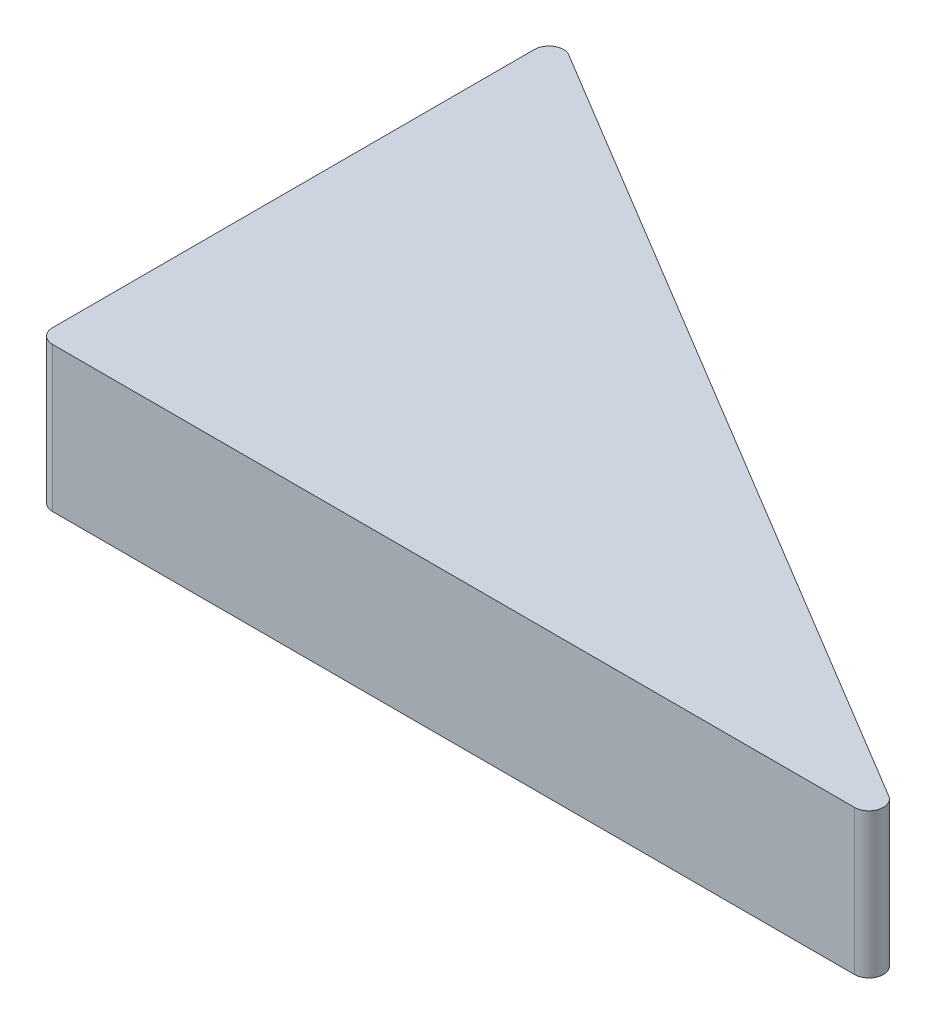
ISO-10303-21;
HEADER;
FILE_DESCRIPTION(('STEP AP214'),'2;1');
FILE_NAME('part.step','',(''),(''),'','','');
FILE_SCHEMA(('AUTOMOTIVE_DESIGN { 1 0 10303 214 1 1 1 1 }'));
ENDSEC;
DATA;
#1=APPLICATION_CONTEXT('core data for automotive mechanical design processes');
#2=APPLICATION_PROTOCOL_DEFINITION('international standard','automotive_design',2000,#1);
#3=PRODUCT_CONTEXT('',#1,'mechanical');
#4=PRODUCT('Part','Part','',(#3));
#5=PRODUCT_RELATED_PRODUCT_CATEGORY('part','',(#4));
#6=PRODUCT_DEFINITION_FORMATION('','',#4);
#7=PRODUCT_DEFINITION_CONTEXT('part definition',#1,'design');
#8=PRODUCT_DEFINITION('design','',#6,#7);
#9=PRODUCT_DEFINITION_SHAPE('','',#8);
#10=(LENGTH_UNIT() NAMED_UNIT(*) SI_UNIT(.MILLI.,.METRE.));
#11=(NAMED_UNIT(*) PLANE_ANGLE_UNIT() SI_UNIT($,.RADIAN.));
#12=(NAMED_UNIT(*) SI_UNIT($,.STERADIAN.) SOLID_ANGLE_UNIT());
#13=UNCERTAINTY_MEASURE_WITH_UNIT(LENGTH_MEASURE(1.E-05),#10,'distance_accuracy_value','');
#14=(GEOMETRIC_REPRESENTATION_CONTEXT(3) GLOBAL_UNCERTAINTY_ASSIGNED_CONTEXT((#13)) GLOBAL_UNIT_ASSIGNED_CONTEXT((#10,
#11,#12)) REPRESENTATION_CONTEXT('',''));
#15=CARTESIAN_POINT('',(0.,0.,0.));
#16=DIRECTION('',(0.,0.,1.));
#17=DIRECTION('',(1.,0.,0.));
#18=AXIS2_PLACEMENT_3D('',#15,#16,#17);
#19=CARTESIAN_POINT('',(56.394448724536,10.,-1.));
#20=DIRECTION('',(0.,-1.,0.));
#21=DIRECTION('',(0.,0.,-1.));
#22=AXIS2_PLACEMENT_3D('',#19,#20,#21);
#23=CYLINDRICAL_SURFACE('',#22,0.999999999999998);
#24=CARTESIAN_POINT('',(56.394448724536,0.,-1.));
#25=DIRECTION('',(0.,1.,0.));
#26=DIRECTION('',(0.,0.,-1.));
#27=AXIS2_PLACEMENT_3D('',#24,#25,#26);
#28=CIRCLE('',#27,0.999999999999998);
#29=CARTESIAN_POINT('',(56.394448724536,0.,0.));
#30=VERTEX_POINT('',#29);
#31=CARTESIAN_POINT('',(56.9095274781737,0.,-1.85714285714286));
#32=VERTEX_POINT('',#31);
#33=EDGE_CURVE('E132',#30,#32,#28,.T.);
#34=ORIENTED_EDGE('',*,*,#33,.T.);
#35=DIRECTION('',(0.,-1.,0.));
#36=VECTOR('',#35,1.);
#37=CARTESIAN_POINT('',(56.9095274781737,10.,-1.85714285714286));
#38=LINE('',#37,#36);
#39=CARTESIAN_POINT('',(56.9095274781737,10.,-1.85714285714286));
#40=VERTEX_POINT('',#39);
#41=EDGE_CURVE('E11',#40,#32,#38,.T.);
#42=ORIENTED_EDGE('',*,*,#41,.F.);
#43=CARTESIAN_POINT('',(56.394448724536,10.,-1.));
#44=DIRECTION('',(0.,1.,0.));
#45=DIRECTION('',(0.,0.,-1.));
#46=AXIS2_PLACEMENT_3D('',#43,#44,#45);
#47=CIRCLE('',#46,0.999999999999998);
#48=CARTESIAN_POINT('',(56.394448724536,10.,0.));
#49=VERTEX_POINT('',#48);
#50=EDGE_CURVE('E148',#49,#40,#47,.T.);
#51=ORIENTED_EDGE('',*,*,#50,.F.);
#52=DIRECTION('',(0.,-1.,0.));
#53=VECTOR('',#52,1.);
#54=CARTESIAN_POINT('',(56.394448724536,10.,0.));
#55=LINE('',#54,#53);
#56=EDGE_CURVE('E128',#49,#30,#55,.T.);
#57=ORIENTED_EDGE('',*,*,#56,.T.);
#58=EDGE_LOOP('',(#34,#42,#51,#57));
#59=FACE_BOUND('',#58,.T.);
#60=ADVANCED_FACE('F43',(#59),#23,.T.);
#61=CARTESIAN_POINT('',(1.51507875363771,10.,-35.1450637325388));
#62=DIRECTION('',(-0.515078753637713,0.,0.857142857142857));
#63=DIRECTION('',(0.857142857142857,0.,0.515078753637713));
#64=AXIS2_PLACEMENT_3D('',#61,#62,#63);
#65=PLANE('',#64);
#66=DIRECTION('',(-0.857142857142857,0.,-0.515078753637713));
#67=VECTOR('',#66,1.);
#68=CARTESIAN_POINT('',(1.51507875363771,0.,-35.1450637325388));
#69=LINE('',#68,#67);
#70=CARTESIAN_POINT('',(1.51507875363771,0.,-35.1450637325388));
#71=VERTEX_POINT('',#70);
#72=EDGE_CURVE('E136',#32,#71,#69,.T.);
#73=ORIENTED_EDGE('',*,*,#72,.T.);
#74=DIRECTION('',(0.,-1.,0.));
#75=VECTOR('',#74,1.);
#76=CARTESIAN_POINT('',(1.51507875363771,10.,-35.1450637325388));
#77=LINE('',#76,#75);
#78=CARTESIAN_POINT('',(1.51507875363771,10.,-35.1450637325388));
#79=VERTEX_POINT('',#78);
#80=EDGE_CURVE('E52',#79,#71,#77,.T.);
#81=ORIENTED_EDGE('',*,*,#80,.F.);
#82=DIRECTION('',(-0.857142857142857,0.,-0.515078753637713));
#83=VECTOR('',#82,1.);
#84=CARTESIAN_POINT('',(1.51507875363771,10.,-35.1450637325388));
#85=LINE('',#84,#83);
#86=EDGE_CURVE('E97',#40,#79,#85,.T.);
#87=ORIENTED_EDGE('',*,*,#86,.F.);
#88=ORIENTED_EDGE('',*,*,#41,.T.);
#89=EDGE_LOOP('',(#73,#81,#87,#88));
#90=FACE_BOUND('',#89,.T.);
#91=ADVANCED_FACE('F176',(#90),#65,.F.);
#92=CARTESIAN_POINT('',(1.,10.,-34.2879208753959));
#93=DIRECTION('',(0.,-1.,0.));
#94=DIRECTION('',(0.,0.,-1.));
#95=AXIS2_PLACEMENT_3D('',#92,#93,#94);
#96=CYLINDRICAL_SURFACE('',#95,0.999999999999997);
#97=CARTESIAN_POINT('',(1.,0.,-34.2879208753959));
#98=DIRECTION('',(0.,1.,0.));
#99=DIRECTION('',(0.,0.,-1.));
#100=AXIS2_PLACEMENT_3D('',#97,#98,#99);
#101=CIRCLE('',#100,0.999999999999997);
#102=CARTESIAN_POINT('',(0.,0.,-34.2879208753959));
#103=VERTEX_POINT('',#102);
#104=EDGE_CURVE('E139',#71,#103,#101,.T.);
#105=ORIENTED_EDGE('',*,*,#104,.T.);
#106=DIRECTION('',(0.,-1.,0.));
#107=VECTOR('',#106,1.);
#108=CARTESIAN_POINT('',(0.,10.,-34.2879208753959));
#109=LINE('',#108,#107);
#110=CARTESIAN_POINT('',(0.,10.,-34.2879208753959));
#111=VERTEX_POINT('',#110);
#112=EDGE_CURVE('E121',#111,#103,#109,.T.);
#113=ORIENTED_EDGE('',*,*,#112,.F.);
#114=CARTESIAN_POINT('',(1.,10.,-34.2879208753959));
#115=DIRECTION('',(0.,1.,0.));
#116=DIRECTION('',(0.,0.,-1.));
#117=AXIS2_PLACEMENT_3D('',#114,#115,#116);
#118=CIRCLE('',#117,0.999999999999997);
#119=EDGE_CURVE('E110',#79,#111,#118,.T.);
#120=ORIENTED_EDGE('',*,*,#119,.F.);
#121=ORIENTED_EDGE('',*,*,#80,.T.);
#122=EDGE_LOOP('',(#105,#113,#120,#121));
#123=FACE_BOUND('',#122,.T.);
#124=ADVANCED_FACE('F158',(#123),#96,.T.);
#125=CARTESIAN_POINT('',(0.,10.,-1.00000000000001));
#126=DIRECTION('',(1.,0.,0.));
#127=DIRECTION('',(0.,0.,-1.));
#128=AXIS2_PLACEMENT_3D('',#125,#126,#127);
#129=PLANE('',#128);
#130=DIRECTION('',(0.,0.,1.));
#131=VECTOR('',#130,1.);
#132=CARTESIAN_POINT('',(0.,0.,-1.00000000000001));
#133=LINE('',#132,#131);
#134=CARTESIAN_POINT('',(0.,0.,-1.00000000000001));
#135=VERTEX_POINT('',#134);
#136=EDGE_CURVE('E119',#103,#135,#133,.T.);
#137=ORIENTED_EDGE('',*,*,#136,.T.);
#138=DIRECTION('',(0.,-1.,0.));
#139=VECTOR('',#138,1.);
#140=CARTESIAN_POINT('',(0.,10.,-1.00000000000001));
#141=LINE('',#140,#139);
#142=CARTESIAN_POINT('',(0.,10.,-1.00000000000001));
#143=VERTEX_POINT('',#142);
#144=EDGE_CURVE('E116',#143,#135,#141,.T.);
#145=ORIENTED_EDGE('',*,*,#144,.F.);
#146=DIRECTION('',(0.,0.,1.));
#147=VECTOR('',#146,1.);
#148=CARTESIAN_POINT('',(0.,10.,-1.00000000000001));
#149=LINE('',#148,#147);
#150=EDGE_CURVE('E104',#111,#143,#149,.T.);
#151=ORIENTED_EDGE('',*,*,#150,.F.);
#152=ORIENTED_EDGE('',*,*,#112,.T.);
#153=EDGE_LOOP('',(#137,#145,#151,#152));
#154=FACE_BOUND('',#153,.T.);
#155=ADVANCED_FACE('F117',(#154),#129,.F.);
#156=CARTESIAN_POINT('',(1.,10.,-1.));
#157=DIRECTION('',(0.,-1.,0.));
#158=DIRECTION('',(0.,0.,-1.));
#159=AXIS2_PLACEMENT_3D('',#156,#157,#158);
#160=CYLINDRICAL_SURFACE('',#159,1.);
#161=CARTESIAN_POINT('',(1.,0.,-1.));
#162=DIRECTION('',(0.,1.,0.));
#163=DIRECTION('',(0.,0.,1.));
#164=AXIS2_PLACEMENT_3D('',#161,#162,#163);
#165=CIRCLE('',#164,1.);
#166=CARTESIAN_POINT('',(1.,0.,0.));
#167=VERTEX_POINT('',#166);
#168=EDGE_CURVE('E83',#135,#167,#165,.T.);
#169=ORIENTED_EDGE('',*,*,#168,.T.);
#170=DIRECTION('',(0.,-1.,0.));
#171=VECTOR('',#170,1.);
#172=CARTESIAN_POINT('',(1.,10.,0.));
#173=LINE('',#172,#171);
#174=CARTESIAN_POINT('',(1.,10.,0.));
#175=VERTEX_POINT('',#174);
#176=EDGE_CURVE('E122',#175,#167,#173,.T.);
#177=ORIENTED_EDGE('',*,*,#176,.F.);
#178=CARTESIAN_POINT('',(1.,10.,-1.));
#179=DIRECTION('',(0.,1.,0.));
#180=DIRECTION('',(0.,0.,1.));
#181=AXIS2_PLACEMENT_3D('',#178,#179,#180);
#182=CIRCLE('',#181,1.);
#183=EDGE_CURVE('E108',#143,#175,#182,.T.);
#184=ORIENTED_EDGE('',*,*,#183,.F.);
#185=ORIENTED_EDGE('',*,*,#144,.T.);
#186=EDGE_LOOP('',(#169,#177,#184,#185));
#187=FACE_BOUND('',#186,.T.);
#188=ADVANCED_FACE('F124',(#187),#160,.T.);
#189=CARTESIAN_POINT('',(56.394448724536,10.,0.));
#190=DIRECTION('',(0.,0.,-1.));
#191=DIRECTION('',(-1.,0.,0.));
#192=AXIS2_PLACEMENT_3D('',#189,#190,#191);
#193=PLANE('',#192);
#194=DIRECTION('',(1.,0.,0.));
#195=VECTOR('',#194,1.);
#196=CARTESIAN_POINT('',(56.394448724536,0.,0.));
#197=LINE('',#196,#195);
#198=EDGE_CURVE('E89',#167,#30,#197,.T.);
#199=ORIENTED_EDGE('',*,*,#198,.T.);
#200=ORIENTED_EDGE('',*,*,#56,.F.);
#201=DIRECTION('',(1.,0.,0.));
#202=VECTOR('',#201,1.);
#203=CARTESIAN_POINT('',(56.394448724536,10.,0.));
#204=LINE('',#203,#202);
#205=EDGE_CURVE('E60',#175,#49,#204,.T.);
#206=ORIENTED_EDGE('',*,*,#205,.F.);
#207=ORIENTED_EDGE('',*,*,#176,.T.);
#208=EDGE_LOOP('',(#199,#200,#206,#207));
#209=FACE_BOUND('',#208,.T.);
#210=ADVANCED_FACE('F165',(#209),#193,.F.);
#211=CARTESIAN_POINT('',(56.394448724536,10.,-1.));
#212=DIRECTION('',(0.,-1.,0.));
#213=DIRECTION('',(0.,0.,-1.));
#214=AXIS2_PLACEMENT_3D('',#211,#212,#213);
#215=PLANE('',#214);
#216=ORIENTED_EDGE('',*,*,#50,.T.);
#217=ORIENTED_EDGE('',*,*,#86,.T.);
#218=ORIENTED_EDGE('',*,*,#119,.T.);
#219=ORIENTED_EDGE('',*,*,#150,.T.);
#220=ORIENTED_EDGE('',*,*,#183,.T.);
#221=ORIENTED_EDGE('',*,*,#205,.T.);
#222=EDGE_LOOP('',(#216,#217,#218,#219,#220,#221));
#223=FACE_BOUND('',#222,.T.);
#224=ADVANCED_FACE('F106',(#223),#215,.F.);
#225=CARTESIAN_POINT('',(56.394448724536,0.,-1.));
#226=DIRECTION('',(0.,-1.,0.));
#227=DIRECTION('',(0.,0.,-1.));
#228=AXIS2_PLACEMENT_3D('',#225,#226,#227);
#229=PLANE('',#228);
#230=ORIENTED_EDGE('',*,*,#33,.F.);
#231=ORIENTED_EDGE('',*,*,#198,.F.);
#232=ORIENTED_EDGE('',*,*,#168,.F.);
#233=ORIENTED_EDGE('',*,*,#136,.F.);
#234=ORIENTED_EDGE('',*,*,#104,.F.);
#235=ORIENTED_EDGE('',*,*,#72,.F.);
#236=EDGE_LOOP('',(#230,#231,#232,#233,#234,#235));
#237=FACE_BOUND('',#236,.T.);
#238=ADVANCED_FACE('F161',(#237),#229,.T.);
#239=CLOSED_SHELL('',(#60,#91,#124,#155,#188,#210,#224,#238));
#240=MANIFOLD_SOLID_BREP('B2',#239);
#241=ADVANCED_BREP_SHAPE_REPRESENTATION('',(#18,#240),#14);
#242=SHAPE_DEFINITION_REPRESENTATION(#9,#241);
ENDSEC;
END-ISO-10303-21;
